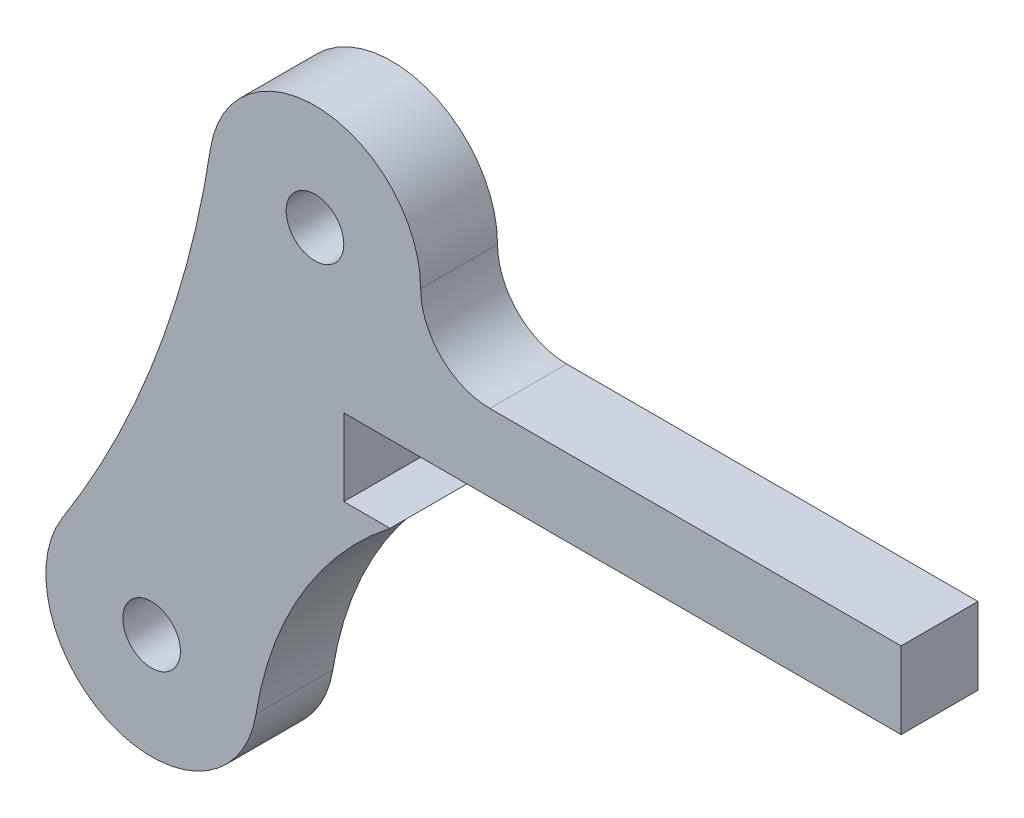
ISO-10303-21;
HEADER;
FILE_DESCRIPTION(('STEP AP214'),'2;1');
FILE_NAME('part.step','',(''),(''),'','','');
FILE_SCHEMA(('AUTOMOTIVE_DESIGN { 1 0 10303 214 1 1 1 1 }'));
ENDSEC;
DATA;
#1=APPLICATION_CONTEXT('core data for automotive mechanical design processes');
#2=APPLICATION_PROTOCOL_DEFINITION('international standard','automotive_design',2000,#1);
#3=PRODUCT_CONTEXT('',#1,'mechanical');
#4=PRODUCT('Part','Part','',(#3));
#5=PRODUCT_RELATED_PRODUCT_CATEGORY('part','',(#4));
#6=PRODUCT_DEFINITION_FORMATION('','',#4);
#7=PRODUCT_DEFINITION_CONTEXT('part definition',#1,'design');
#8=PRODUCT_DEFINITION('design','',#6,#7);
#9=PRODUCT_DEFINITION_SHAPE('','',#8);
#10=(LENGTH_UNIT() NAMED_UNIT(*) SI_UNIT(.MILLI.,.METRE.));
#11=(NAMED_UNIT(*) PLANE_ANGLE_UNIT() SI_UNIT($,.RADIAN.));
#12=(NAMED_UNIT(*) SI_UNIT($,.STERADIAN.) SOLID_ANGLE_UNIT());
#13=UNCERTAINTY_MEASURE_WITH_UNIT(LENGTH_MEASURE(1.E-05),#10,'distance_accuracy_value','');
#14=(GEOMETRIC_REPRESENTATION_CONTEXT(3) GLOBAL_UNCERTAINTY_ASSIGNED_CONTEXT((#13)) GLOBAL_UNIT_ASSIGNED_CONTEXT((#10,
#11,#12)) REPRESENTATION_CONTEXT('',''));
#15=CARTESIAN_POINT('',(0.,0.,0.));
#16=DIRECTION('',(0.,0.,1.));
#17=DIRECTION('',(1.,0.,0.));
#18=AXIS2_PLACEMENT_3D('',#15,#16,#17);
#19=CARTESIAN_POINT('',(-8.5,-22.6,4.));
#20=DIRECTION('',(0.,0.,-1.));
#21=DIRECTION('',(-1.,0.,0.));
#22=AXIS2_PLACEMENT_3D('',#19,#20,#21);
#23=CYLINDRICAL_SURFACE('',#22,5.5);
#24=CARTESIAN_POINT('',(-8.5,-22.6,0.));
#25=DIRECTION('',(0.,0.,1.));
#26=DIRECTION('',(1.,0.,0.));
#27=AXIS2_PLACEMENT_3D('',#24,#25,#26);
#28=CIRCLE('',#27,5.5);
#29=CARTESIAN_POINT('',(-13.1420484719244,-19.6501888222627,0.));
#30=VERTEX_POINT('',#29);
#31=CARTESIAN_POINT('',(-3.06762860727729,-23.4598494353827,0.));
#32=VERTEX_POINT('',#31);
#33=EDGE_CURVE('E161',#30,#32,#28,.T.);
#34=ORIENTED_EDGE('',*,*,#33,.T.);
#35=DIRECTION('',(0.,0.,-1.));
#36=VECTOR('',#35,1.);
#37=CARTESIAN_POINT('',(-3.06762860727729,-23.4598494353827,4.));
#38=LINE('',#37,#36);
#39=CARTESIAN_POINT('',(-3.06762860727729,-23.4598494353827,4.));
#40=VERTEX_POINT('',#39);
#41=EDGE_CURVE('E209',#40,#32,#38,.T.);
#42=ORIENTED_EDGE('',*,*,#41,.F.);
#43=CARTESIAN_POINT('',(-8.5,-22.6,4.));
#44=DIRECTION('',(0.,0.,1.));
#45=DIRECTION('',(1.,0.,0.));
#46=AXIS2_PLACEMENT_3D('',#43,#44,#45);
#47=CIRCLE('',#46,5.5);
#48=CARTESIAN_POINT('',(-13.1420484719244,-19.6501888222627,4.));
#49=VERTEX_POINT('',#48);
#50=EDGE_CURVE('E196',#49,#40,#47,.T.);
#51=ORIENTED_EDGE('',*,*,#50,.F.);
#52=DIRECTION('',(0.,0.,-1.));
#53=VECTOR('',#52,1.);
#54=CARTESIAN_POINT('',(-13.1420484719244,-19.6501888222627,4.));
#55=LINE('',#54,#53);
#56=EDGE_CURVE('E160',#49,#30,#55,.T.);
#57=ORIENTED_EDGE('',*,*,#56,.T.);
#58=EDGE_LOOP('',(#34,#42,#51,#57));
#59=FACE_BOUND('',#58,.T.);
#60=ADVANCED_FACE('F41',(#59),#23,.T.);
#61=CARTESIAN_POINT('',(15.5,-26.3987804878049,4.));
#62=DIRECTION('',(0.,0.,-1.));
#63=DIRECTION('',(-1.,0.,0.));
#64=AXIS2_PLACEMENT_3D('',#61,#62,#63);
#65=CYLINDRICAL_SURFACE('',#64,18.7987804878049);
#66=CARTESIAN_POINT('',(15.5,-26.3987804878049,0.));
#67=DIRECTION('',(0.,0.,1.));
#68=DIRECTION('',(1.,0.,0.));
#69=AXIS2_PLACEMENT_3D('',#66,#67,#68);
#70=CIRCLE('',#69,18.7987804878049);
#71=CARTESIAN_POINT('',(3.90731938236721,-11.6,0.));
#72=VERTEX_POINT('',#71);
#73=EDGE_CURVE('E165',#32,#72,#70,.F.);
#74=ORIENTED_EDGE('',*,*,#73,.T.);
#75=DIRECTION('',(0.,0.,-1.));
#76=VECTOR('',#75,1.);
#77=CARTESIAN_POINT('',(3.90731938236721,-11.6,4.));
#78=LINE('',#77,#76);
#79=CARTESIAN_POINT('',(3.90731938236721,-11.6,4.));
#80=VERTEX_POINT('',#79);
#81=EDGE_CURVE('E56',#72,#80,#78,.F.);
#82=ORIENTED_EDGE('',*,*,#81,.T.);
#83=CARTESIAN_POINT('',(15.5,-26.3987804878049,4.));
#84=DIRECTION('',(0.,0.,1.));
#85=DIRECTION('',(1.,0.,0.));
#86=AXIS2_PLACEMENT_3D('',#83,#84,#85);
#87=CIRCLE('',#86,18.7987804878049);
#88=EDGE_CURVE('E103',#40,#80,#87,.F.);
#89=ORIENTED_EDGE('',*,*,#88,.F.);
#90=ORIENTED_EDGE('',*,*,#41,.T.);
#91=EDGE_LOOP('',(#74,#82,#89,#90));
#92=FACE_BOUND('',#91,.T.);
#93=ADVANCED_FACE('F221',(#92),#65,.F.);
#94=CARTESIAN_POINT('',(0.,-7.6,4.));
#95=DIRECTION('',(0.,1.,0.));
#96=DIRECTION('',(0.,0.,1.));
#97=AXIS2_PLACEMENT_3D('',#94,#95,#96);
#98=PLANE('',#97);
#99=DIRECTION('',(1.,0.,0.));
#100=VECTOR('',#99,1.);
#101=CARTESIAN_POINT('',(0.,-7.6,0.));
#102=LINE('',#101,#100);
#103=CARTESIAN_POINT('',(1.5,-7.6,0.));
#104=VERTEX_POINT('',#103);
#105=CARTESIAN_POINT('',(30.5,-7.6,0.));
#106=VERTEX_POINT('',#105);
#107=EDGE_CURVE('E169',#104,#106,#102,.T.);
#108=ORIENTED_EDGE('',*,*,#107,.T.);
#109=DIRECTION('',(0.,0.,-1.));
#110=VECTOR('',#109,1.);
#111=CARTESIAN_POINT('',(30.5,-7.6,4.));
#112=LINE('',#111,#110);
#113=CARTESIAN_POINT('',(30.5,-7.6,4.));
#114=VERTEX_POINT('',#113);
#115=EDGE_CURVE('E206',#114,#106,#112,.T.);
#116=ORIENTED_EDGE('',*,*,#115,.F.);
#117=DIRECTION('',(1.,0.,0.));
#118=VECTOR('',#117,1.);
#119=CARTESIAN_POINT('',(0.,-7.6,4.));
#120=LINE('',#119,#118);
#121=CARTESIAN_POINT('',(1.5,-7.6,4.));
#122=VERTEX_POINT('',#121);
#123=EDGE_CURVE('E230',#122,#114,#120,.T.);
#124=ORIENTED_EDGE('',*,*,#123,.F.);
#125=DIRECTION('',(0.,0.,1.));
#126=VECTOR('',#125,1.);
#127=CARTESIAN_POINT('',(1.5,-7.6,-6.));
#128=LINE('',#127,#126);
#129=EDGE_CURVE('E253',#104,#122,#128,.T.);
#130=ORIENTED_EDGE('',*,*,#129,.F.);
#131=EDGE_LOOP('',(#108,#116,#124,#130));
#132=FACE_BOUND('',#131,.T.);
#133=ADVANCED_FACE('F255',(#132),#98,.F.);
#134=CARTESIAN_POINT('',(30.5,0.,4.));
#135=DIRECTION('',(1.,0.,0.));
#136=DIRECTION('',(0.,0.,-1.));
#137=AXIS2_PLACEMENT_3D('',#134,#135,#136);
#138=PLANE('',#137);
#139=DIRECTION('',(0.,-1.,0.));
#140=VECTOR('',#139,1.);
#141=CARTESIAN_POINT('',(30.5,0.,0.));
#142=LINE('',#141,#140);
#143=CARTESIAN_POINT('',(30.5,-3.6,0.));
#144=VERTEX_POINT('',#143);
#145=EDGE_CURVE('E173',#144,#106,#142,.T.);
#146=ORIENTED_EDGE('',*,*,#145,.F.);
#147=DIRECTION('',(0.,0.,-1.));
#148=VECTOR('',#147,1.);
#149=CARTESIAN_POINT('',(30.5,-3.6,4.));
#150=LINE('',#149,#148);
#151=CARTESIAN_POINT('',(30.5,-3.6,4.));
#152=VERTEX_POINT('',#151);
#153=EDGE_CURVE('E203',#152,#144,#150,.T.);
#154=ORIENTED_EDGE('',*,*,#153,.F.);
#155=DIRECTION('',(0.,-1.,0.));
#156=VECTOR('',#155,1.);
#157=CARTESIAN_POINT('',(30.5,0.,4.));
#158=LINE('',#157,#156);
#159=EDGE_CURVE('E146',#152,#114,#158,.T.);
#160=ORIENTED_EDGE('',*,*,#159,.T.);
#161=ORIENTED_EDGE('',*,*,#115,.T.);
#162=EDGE_LOOP('',(#146,#154,#160,#161));
#163=FACE_BOUND('',#162,.T.);
#164=ADVANCED_FACE('F240',(#163),#138,.T.);
#165=CARTESIAN_POINT('',(0.,-3.6,4.));
#166=DIRECTION('',(0.,1.,0.));
#167=DIRECTION('',(0.,0.,1.));
#168=AXIS2_PLACEMENT_3D('',#165,#166,#167);
#169=PLANE('',#168);
#170=DIRECTION('',(1.,0.,0.));
#171=VECTOR('',#170,1.);
#172=CARTESIAN_POINT('',(0.,-3.6,0.));
#173=LINE('',#172,#171);
#174=CARTESIAN_POINT('',(9.1,-3.6,0.));
#175=VERTEX_POINT('',#174);
#176=EDGE_CURVE('E177',#175,#144,#173,.T.);
#177=ORIENTED_EDGE('',*,*,#176,.F.);
#178=DIRECTION('',(0.,0.,-1.));
#179=VECTOR('',#178,1.);
#180=CARTESIAN_POINT('',(9.1,-3.6,4.));
#181=LINE('',#180,#179);
#182=CARTESIAN_POINT('',(9.1,-3.6,4.));
#183=VERTEX_POINT('',#182);
#184=EDGE_CURVE('E128',#183,#175,#181,.T.);
#185=ORIENTED_EDGE('',*,*,#184,.F.);
#186=DIRECTION('',(1.,0.,0.));
#187=VECTOR('',#186,1.);
#188=CARTESIAN_POINT('',(0.,-3.6,4.));
#189=LINE('',#188,#187);
#190=EDGE_CURVE('E142',#183,#152,#189,.T.);
#191=ORIENTED_EDGE('',*,*,#190,.T.);
#192=ORIENTED_EDGE('',*,*,#153,.T.);
#193=EDGE_LOOP('',(#177,#185,#191,#192));
#194=FACE_BOUND('',#193,.T.);
#195=ADVANCED_FACE('F245',(#194),#169,.T.);
#196=CARTESIAN_POINT('',(9.1,0.,4.));
#197=DIRECTION('',(0.,0.,-1.));
#198=DIRECTION('',(-1.,0.,0.));
#199=AXIS2_PLACEMENT_3D('',#196,#197,#198);
#200=CYLINDRICAL_SURFACE('',#199,3.6);
#201=CARTESIAN_POINT('',(9.1,0.,0.));
#202=DIRECTION('',(0.,0.,1.));
#203=DIRECTION('',(1.,0.,0.));
#204=AXIS2_PLACEMENT_3D('',#201,#202,#203);
#205=CIRCLE('',#204,3.6);
#206=CARTESIAN_POINT('',(5.5,0.,0.));
#207=VERTEX_POINT('',#206);
#208=EDGE_CURVE('E124',#207,#175,#205,.T.);
#209=ORIENTED_EDGE('',*,*,#208,.F.);
#210=DIRECTION('',(0.,0.,-1.));
#211=VECTOR('',#210,1.);
#212=CARTESIAN_POINT('',(5.5,0.,4.));
#213=LINE('',#212,#211);
#214=CARTESIAN_POINT('',(5.5,0.,4.));
#215=VERTEX_POINT('',#214);
#216=EDGE_CURVE('E118',#215,#207,#213,.T.);
#217=ORIENTED_EDGE('',*,*,#216,.F.);
#218=CARTESIAN_POINT('',(9.1,0.,4.));
#219=DIRECTION('',(0.,0.,1.));
#220=DIRECTION('',(1.,0.,0.));
#221=AXIS2_PLACEMENT_3D('',#218,#219,#220);
#222=CIRCLE('',#221,3.6);
#223=EDGE_CURVE('E122',#215,#183,#222,.T.);
#224=ORIENTED_EDGE('',*,*,#223,.T.);
#225=ORIENTED_EDGE('',*,*,#184,.T.);
#226=EDGE_LOOP('',(#209,#217,#224,#225));
#227=FACE_BOUND('',#226,.T.);
#228=ADVANCED_FACE('F120',(#227),#200,.F.);
#229=CARTESIAN_POINT('',(0.,0.,4.));
#230=DIRECTION('',(0.,0.,-1.));
#231=DIRECTION('',(-1.,0.,0.));
#232=AXIS2_PLACEMENT_3D('',#229,#230,#231);
#233=CYLINDRICAL_SURFACE('',#232,5.5);
#234=CARTESIAN_POINT('',(0.,0.,0.));
#235=DIRECTION('',(0.,0.,1.));
#236=DIRECTION('',(1.,0.,0.));
#237=AXIS2_PLACEMENT_3D('',#234,#235,#236);
#238=CIRCLE('',#237,5.5);
#239=CARTESIAN_POINT('',(-5.43541642495027,0.840385796750978,0.));
#240=VERTEX_POINT('',#239);
#241=EDGE_CURVE('E183',#207,#240,#238,.T.);
#242=ORIENTED_EDGE('',*,*,#241,.T.);
#243=DIRECTION('',(0.,0.,-1.));
#244=VECTOR('',#243,1.);
#245=CARTESIAN_POINT('',(-5.43541642495027,0.840385796750978,4.));
#246=LINE('',#245,#244);
#247=CARTESIAN_POINT('',(-5.43541642495027,0.840385796750978,4.));
#248=VERTEX_POINT('',#247);
#249=EDGE_CURVE('E129',#248,#240,#246,.T.);
#250=ORIENTED_EDGE('',*,*,#249,.F.);
#251=CARTESIAN_POINT('',(0.,0.,4.));
#252=DIRECTION('',(0.,0.,1.));
#253=DIRECTION('',(1.,0.,0.));
#254=AXIS2_PLACEMENT_3D('',#251,#252,#253);
#255=CIRCLE('',#254,5.5);
#256=EDGE_CURVE('E132',#215,#248,#255,.T.);
#257=ORIENTED_EDGE('',*,*,#256,.F.);
#258=ORIENTED_EDGE('',*,*,#216,.T.);
#259=EDGE_LOOP('',(#242,#250,#257,#258));
#260=FACE_BOUND('',#259,.T.);
#261=ADVANCED_FACE('F133',(#260),#233,.T.);
#262=CARTESIAN_POINT('',(0.,0.,4.));
#263=DIRECTION('',(0.,0.,-1.));
#264=DIRECTION('',(-1.,0.,0.));
#265=AXIS2_PLACEMENT_3D('',#262,#263,#264);
#266=CYLINDRICAL_SURFACE('',#265,1.5);
#267=CARTESIAN_POINT('',(0.,0.,4.));
#268=DIRECTION('',(0.,0.,1.));
#269=DIRECTION('',(1.,0.,0.));
#270=AXIS2_PLACEMENT_3D('',#267,#268,#269);
#271=CIRCLE('',#270,1.5);
#272=CARTESIAN_POINT('',(1.5,0.,4.));
#273=VERTEX_POINT('',#272);
#274=EDGE_CURVE('E152',#273,#273,#271,.T.);
#275=ORIENTED_EDGE('',*,*,#274,.T.);
#276=EDGE_LOOP('',(#275));
#277=FACE_BOUND('',#276,.T.);
#278=CARTESIAN_POINT('',(0.,0.,0.));
#279=DIRECTION('',(0.,0.,1.));
#280=DIRECTION('',(1.,0.,0.));
#281=AXIS2_PLACEMENT_3D('',#278,#279,#280);
#282=CIRCLE('',#281,1.5);
#283=CARTESIAN_POINT('',(1.5,0.,0.));
#284=VERTEX_POINT('',#283);
#285=EDGE_CURVE('E188',#284,#284,#282,.T.);
#286=ORIENTED_EDGE('',*,*,#285,.F.);
#287=EDGE_LOOP('',(#286));
#288=FACE_BOUND('',#287,.T.);
#289=ADVANCED_FACE('F295',(#277,#288),#266,.F.);
#290=CARTESIAN_POINT('',(-58.2340633193854,9.00374062897238,4.));
#291=DIRECTION('',(0.,0.,-1.));
#292=DIRECTION('',(-1.,0.,0.));
#293=AXIS2_PLACEMENT_3D('',#290,#291,#292);
#294=CYLINDRICAL_SURFACE('',#293,53.426);
#295=CARTESIAN_POINT('',(-58.2340633193854,9.00374062897238,0.));
#296=DIRECTION('',(0.,0.,1.));
#297=DIRECTION('',(1.,0.,0.));
#298=AXIS2_PLACEMENT_3D('',#295,#296,#297);
#299=CIRCLE('',#298,53.426);
#300=EDGE_CURVE('E95',#240,#30,#299,.F.);
#301=ORIENTED_EDGE('',*,*,#300,.T.);
#302=ORIENTED_EDGE('',*,*,#56,.F.);
#303=CARTESIAN_POINT('',(-58.2340633193854,9.00374062897238,4.));
#304=DIRECTION('',(0.,0.,1.));
#305=DIRECTION('',(1.,0.,0.));
#306=AXIS2_PLACEMENT_3D('',#303,#304,#305);
#307=CIRCLE('',#306,53.426);
#308=EDGE_CURVE('E65',#248,#49,#307,.F.);
#309=ORIENTED_EDGE('',*,*,#308,.F.);
#310=ORIENTED_EDGE('',*,*,#249,.T.);
#311=EDGE_LOOP('',(#301,#302,#309,#310));
#312=FACE_BOUND('',#311,.T.);
#313=ADVANCED_FACE('F226',(#312),#294,.F.);
#314=CARTESIAN_POINT('',(-8.5,-22.6,4.));
#315=DIRECTION('',(0.,0.,-1.));
#316=DIRECTION('',(-1.,0.,0.));
#317=AXIS2_PLACEMENT_3D('',#314,#315,#316);
#318=CYLINDRICAL_SURFACE('',#317,1.5);
#319=CARTESIAN_POINT('',(-8.5,-22.6,4.));
#320=DIRECTION('',(0.,0.,1.));
#321=DIRECTION('',(1.,0.,0.));
#322=AXIS2_PLACEMENT_3D('',#319,#320,#321);
#323=CIRCLE('',#322,1.5);
#324=CARTESIAN_POINT('',(-7.,-22.6,4.));
#325=VERTEX_POINT('',#324);
#326=EDGE_CURVE('E156',#325,#325,#323,.T.);
#327=ORIENTED_EDGE('',*,*,#326,.T.);
#328=EDGE_LOOP('',(#327));
#329=FACE_BOUND('',#328,.T.);
#330=CARTESIAN_POINT('',(-8.5,-22.6,0.));
#331=DIRECTION('',(0.,0.,1.));
#332=DIRECTION('',(1.,0.,0.));
#333=AXIS2_PLACEMENT_3D('',#330,#331,#332);
#334=CIRCLE('',#333,1.5);
#335=CARTESIAN_POINT('',(-7.,-22.6,0.));
#336=VERTEX_POINT('',#335);
#337=EDGE_CURVE('E192',#336,#336,#334,.T.);
#338=ORIENTED_EDGE('',*,*,#337,.F.);
#339=EDGE_LOOP('',(#338));
#340=FACE_BOUND('',#339,.T.);
#341=ADVANCED_FACE('F298',(#329,#340),#318,.F.);
#342=CARTESIAN_POINT('',(0.,0.,4.));
#343=DIRECTION('',(0.,0.,1.));
#344=DIRECTION('',(1.,0.,0.));
#345=AXIS2_PLACEMENT_3D('',#342,#343,#344);
#346=PLANE('',#345);
#347=DIRECTION('',(0.,-1.,0.));
#348=VECTOR('',#347,1.);
#349=CARTESIAN_POINT('',(1.5,-7.6,4.));
#350=LINE('',#349,#348);
#351=CARTESIAN_POINT('',(1.5,-11.6,4.));
#352=VERTEX_POINT('',#351);
#353=EDGE_CURVE('E264',#122,#352,#350,.T.);
#354=ORIENTED_EDGE('',*,*,#353,.F.);
#355=ORIENTED_EDGE('',*,*,#123,.T.);
#356=ORIENTED_EDGE('',*,*,#159,.F.);
#357=ORIENTED_EDGE('',*,*,#190,.F.);
#358=ORIENTED_EDGE('',*,*,#223,.F.);
#359=ORIENTED_EDGE('',*,*,#256,.T.);
#360=ORIENTED_EDGE('',*,*,#308,.T.);
#361=ORIENTED_EDGE('',*,*,#50,.T.);
#362=ORIENTED_EDGE('',*,*,#88,.T.);
#363=DIRECTION('',(1.,0.,0.));
#364=VECTOR('',#363,1.);
#365=CARTESIAN_POINT('',(1.5,-11.6,4.));
#366=LINE('',#365,#364);
#367=EDGE_CURVE('E260',#352,#80,#366,.T.);
#368=ORIENTED_EDGE('',*,*,#367,.F.);
#369=EDGE_LOOP('',(#354,#355,#356,#357,#358,#359,#360,#361,#362,#368));
#370=FACE_BOUND('',#369,.T.);
#371=ORIENTED_EDGE('',*,*,#274,.F.);
#372=EDGE_LOOP('',(#371));
#373=FACE_BOUND('',#372,.T.);
#374=ORIENTED_EDGE('',*,*,#326,.F.);
#375=EDGE_LOOP('',(#374));
#376=FACE_BOUND('',#375,.T.);
#377=ADVANCED_FACE('F138',(#370,#373,#376),#346,.T.);
#378=CARTESIAN_POINT('',(0.,0.,0.));
#379=DIRECTION('',(0.,0.,1.));
#380=DIRECTION('',(1.,0.,0.));
#381=AXIS2_PLACEMENT_3D('',#378,#379,#380);
#382=PLANE('',#381);
#383=ORIENTED_EDGE('',*,*,#107,.F.);
#384=DIRECTION('',(0.,-1.,0.));
#385=VECTOR('',#384,1.);
#386=CARTESIAN_POINT('',(1.5,0.,0.));
#387=LINE('',#386,#385);
#388=CARTESIAN_POINT('',(1.5,-11.6,0.));
#389=VERTEX_POINT('',#388);
#390=EDGE_CURVE('E11',#104,#389,#387,.T.);
#391=ORIENTED_EDGE('',*,*,#390,.T.);
#392=DIRECTION('',(1.,0.,0.));
#393=VECTOR('',#392,1.);
#394=CARTESIAN_POINT('',(0.,-11.6,0.));
#395=LINE('',#394,#393);
#396=EDGE_CURVE('E49',#389,#72,#395,.T.);
#397=ORIENTED_EDGE('',*,*,#396,.T.);
#398=ORIENTED_EDGE('',*,*,#73,.F.);
#399=ORIENTED_EDGE('',*,*,#33,.F.);
#400=ORIENTED_EDGE('',*,*,#300,.F.);
#401=ORIENTED_EDGE('',*,*,#241,.F.);
#402=ORIENTED_EDGE('',*,*,#208,.T.);
#403=ORIENTED_EDGE('',*,*,#176,.T.);
#404=ORIENTED_EDGE('',*,*,#145,.T.);
#405=EDGE_LOOP('',(#383,#391,#397,#398,#399,#400,#401,#402,#403,#404));
#406=FACE_BOUND('',#405,.T.);
#407=ORIENTED_EDGE('',*,*,#285,.T.);
#408=EDGE_LOOP('',(#407));
#409=FACE_BOUND('',#408,.T.);
#410=ORIENTED_EDGE('',*,*,#337,.T.);
#411=EDGE_LOOP('',(#410));
#412=FACE_BOUND('',#411,.T.);
#413=ADVANCED_FACE('F214',(#406,#409,#412),#382,.F.);
#414=CARTESIAN_POINT('',(1.5,-7.6,-6.));
#415=DIRECTION('',(-1.,0.,0.));
#416=DIRECTION('',(0.,-1.,0.));
#417=AXIS2_PLACEMENT_3D('',#414,#415,#416);
#418=PLANE('',#417);
#419=ORIENTED_EDGE('',*,*,#129,.T.);
#420=ORIENTED_EDGE('',*,*,#353,.T.);
#421=DIRECTION('',(0.,0.,1.));
#422=VECTOR('',#421,1.);
#423=CARTESIAN_POINT('',(1.5,-11.6,-6.));
#424=LINE('',#423,#422);
#425=EDGE_CURVE('E254',#389,#352,#424,.T.);
#426=ORIENTED_EDGE('',*,*,#425,.F.);
#427=ORIENTED_EDGE('',*,*,#390,.F.);
#428=EDGE_LOOP('',(#419,#420,#426,#427));
#429=FACE_BOUND('',#428,.T.);
#430=ADVANCED_FACE('F250',(#429),#418,.F.);
#431=CARTESIAN_POINT('',(1.5,-11.6,-6.));
#432=DIRECTION('',(0.,-1.,0.));
#433=DIRECTION('',(0.,0.,-1.));
#434=AXIS2_PLACEMENT_3D('',#431,#432,#433);
#435=PLANE('',#434);
#436=ORIENTED_EDGE('',*,*,#396,.F.);
#437=ORIENTED_EDGE('',*,*,#425,.T.);
#438=ORIENTED_EDGE('',*,*,#367,.T.);
#439=ORIENTED_EDGE('',*,*,#81,.F.);
#440=EDGE_LOOP('',(#436,#437,#438,#439));
#441=FACE_BOUND('',#440,.T.);
#442=ADVANCED_FACE('F269',(#441),#435,.F.);
#443=CLOSED_SHELL('',(#60,#93,#133,#164,#195,#228,#261,#289,#313,#341,#377,#413,#430,#442));
#444=MANIFOLD_SOLID_BREP('B2',#443);
#445=ADVANCED_BREP_SHAPE_REPRESENTATION('',(#18,#444),#14);
#446=SHAPE_DEFINITION_REPRESENTATION(#9,#445);
ENDSEC;
END-ISO-10303-21;
